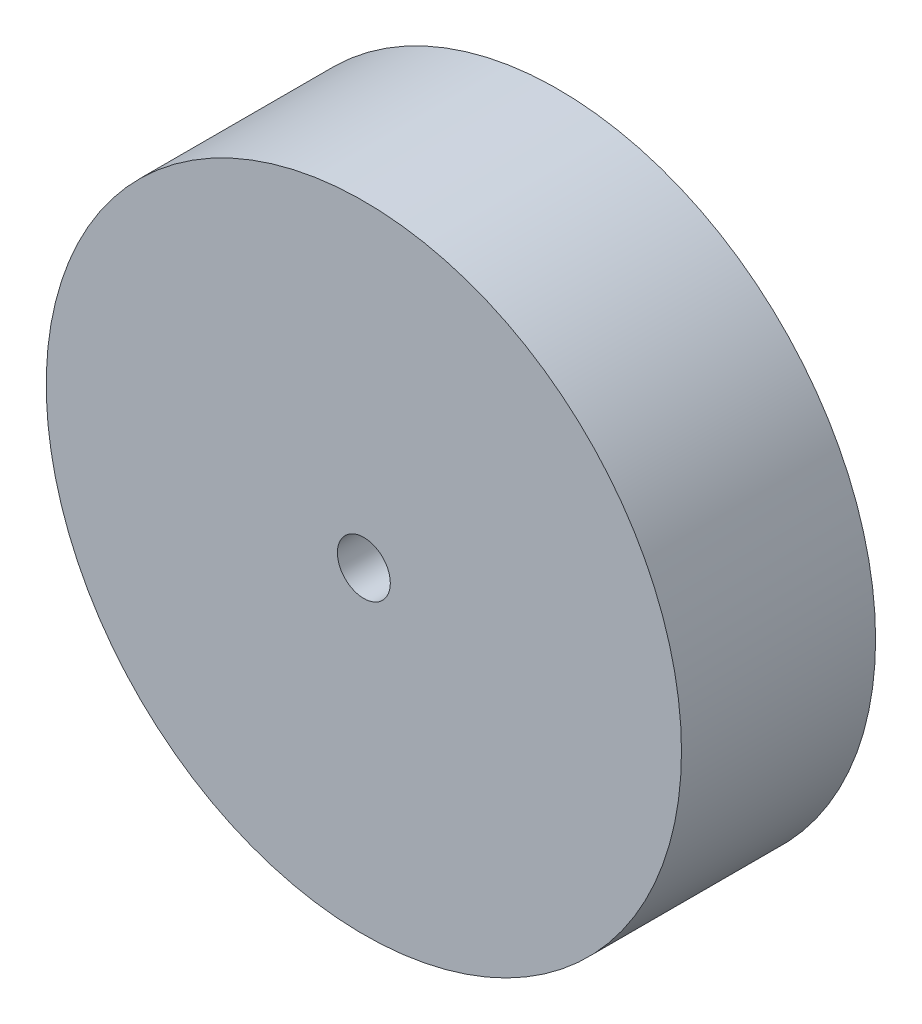
ISO-10303-21;
HEADER;
FILE_DESCRIPTION(('STEP AP214'),'2;1');
FILE_NAME('part.step','',(''),(''),'','','');
FILE_SCHEMA(('AUTOMOTIVE_DESIGN { 1 0 10303 214 1 1 1 1 }'));
ENDSEC;
DATA;
#1=APPLICATION_CONTEXT('core data for automotive mechanical design processes');
#2=APPLICATION_PROTOCOL_DEFINITION('international standard','automotive_design',2000,#1);
#3=PRODUCT_CONTEXT('',#1,'mechanical');
#4=PRODUCT('Part','Part','',(#3));
#5=PRODUCT_RELATED_PRODUCT_CATEGORY('part','',(#4));
#6=PRODUCT_DEFINITION_FORMATION('','',#4);
#7=PRODUCT_DEFINITION_CONTEXT('part definition',#1,'design');
#8=PRODUCT_DEFINITION('design','',#6,#7);
#9=PRODUCT_DEFINITION_SHAPE('','',#8);
#10=(LENGTH_UNIT() NAMED_UNIT(*) SI_UNIT(.MILLI.,.METRE.));
#11=(NAMED_UNIT(*) PLANE_ANGLE_UNIT() SI_UNIT($,.RADIAN.));
#12=(NAMED_UNIT(*) SI_UNIT($,.STERADIAN.) SOLID_ANGLE_UNIT());
#13=UNCERTAINTY_MEASURE_WITH_UNIT(LENGTH_MEASURE(1.E-05),#10,'distance_accuracy_value','');
#14=(GEOMETRIC_REPRESENTATION_CONTEXT(3) GLOBAL_UNCERTAINTY_ASSIGNED_CONTEXT((#13)) GLOBAL_UNIT_ASSIGNED_CONTEXT((#10,
#11,#12)) REPRESENTATION_CONTEXT('',''));
#15=CARTESIAN_POINT('',(0.,0.,0.));
#16=DIRECTION('',(0.,0.,1.));
#17=DIRECTION('',(1.,0.,0.));
#18=AXIS2_PLACEMENT_3D('',#15,#16,#17);
#19=CARTESIAN_POINT('',(0.,0.,3.));
#20=DIRECTION('',(0.,0.,-1.));
#21=DIRECTION('',(-1.,0.,0.));
#22=AXIS2_PLACEMENT_3D('',#19,#20,#21);
#23=CYLINDRICAL_SURFACE('',#22,2.75);
#24=CARTESIAN_POINT('',(0.,0.,3.));
#25=DIRECTION('',(0.,0.,1.));
#26=DIRECTION('',(1.,0.,0.));
#27=AXIS2_PLACEMENT_3D('',#24,#25,#26);
#28=CIRCLE('',#27,2.75);
#29=CARTESIAN_POINT('',(2.75,0.,3.));
#30=VERTEX_POINT('',#29);
#31=EDGE_CURVE('E41',#30,#30,#28,.T.);
#32=ORIENTED_EDGE('',*,*,#31,.F.);
#33=EDGE_LOOP('',(#32));
#34=FACE_BOUND('',#33,.T.);
#35=CARTESIAN_POINT('',(0.,0.,0.));
#36=DIRECTION('',(0.,0.,1.));
#37=DIRECTION('',(1.,0.,0.));
#38=AXIS2_PLACEMENT_3D('',#35,#36,#37);
#39=CIRCLE('',#38,2.75);
#40=CARTESIAN_POINT('',(2.75,0.,0.));
#41=VERTEX_POINT('',#40);
#42=EDGE_CURVE('E45',#41,#41,#39,.T.);
#43=ORIENTED_EDGE('',*,*,#42,.T.);
#44=EDGE_LOOP('',(#43));
#45=FACE_BOUND('',#44,.T.);
#46=ADVANCED_FACE('F30',(#34,#45),#23,.T.);
#47=CARTESIAN_POINT('',(0.,0.,0.));
#48=DIRECTION('',(0.,0.,1.));
#49=DIRECTION('',(1.,0.,0.));
#50=AXIS2_PLACEMENT_3D('',#47,#48,#49);
#51=PLANE('',#50);
#52=ORIENTED_EDGE('',*,*,#42,.F.);
#53=EDGE_LOOP('',(#52));
#54=FACE_BOUND('',#53,.T.);
#55=ADVANCED_FACE('F72',(#54),#51,.F.);
#56=CARTESIAN_POINT('',(0.,0.,8.5));
#57=DIRECTION('',(0.,0.,-1.));
#58=DIRECTION('',(-1.,0.,0.));
#59=AXIS2_PLACEMENT_3D('',#56,#57,#58);
#60=CYLINDRICAL_SURFACE('',#59,9.);
#61=CARTESIAN_POINT('',(0.,0.,8.5));
#62=DIRECTION('',(0.,0.,1.));
#63=DIRECTION('',(1.,0.,0.));
#64=AXIS2_PLACEMENT_3D('',#61,#62,#63);
#65=CIRCLE('',#64,9.);
#66=CARTESIAN_POINT('',(9.,0.,8.5));
#67=VERTEX_POINT('',#66);
#68=EDGE_CURVE('E49',#67,#67,#65,.T.);
#69=ORIENTED_EDGE('',*,*,#68,.F.);
#70=EDGE_LOOP('',(#69));
#71=FACE_BOUND('',#70,.T.);
#72=CARTESIAN_POINT('',(0.,0.,3.));
#73=DIRECTION('',(0.,0.,1.));
#74=DIRECTION('',(1.,0.,0.));
#75=AXIS2_PLACEMENT_3D('',#72,#73,#74);
#76=CIRCLE('',#75,9.);
#77=CARTESIAN_POINT('',(9.,0.,3.));
#78=VERTEX_POINT('',#77);
#79=EDGE_CURVE('E51',#78,#78,#76,.T.);
#80=ORIENTED_EDGE('',*,*,#79,.T.);
#81=EDGE_LOOP('',(#80));
#82=FACE_BOUND('',#81,.T.);
#83=ADVANCED_FACE('F66',(#71,#82),#60,.T.);
#84=CARTESIAN_POINT('',(0.,0.,8.5));
#85=DIRECTION('',(0.,0.,1.));
#86=DIRECTION('',(1.,0.,0.));
#87=AXIS2_PLACEMENT_3D('',#84,#85,#86);
#88=PLANE('',#87);
#89=CARTESIAN_POINT('',(0.,0.,8.5));
#90=DIRECTION('',(0.,0.,1.));
#91=DIRECTION('',(1.,0.,0.));
#92=AXIS2_PLACEMENT_3D('',#89,#90,#91);
#93=CIRCLE('',#92,0.75);
#94=CARTESIAN_POINT('',(0.75,0.,8.5));
#95=VERTEX_POINT('',#94);
#96=EDGE_CURVE('E54',#95,#95,#93,.T.);
#97=ORIENTED_EDGE('',*,*,#96,.F.);
#98=EDGE_LOOP('',(#97));
#99=FACE_BOUND('',#98,.T.);
#100=ORIENTED_EDGE('',*,*,#68,.T.);
#101=EDGE_LOOP('',(#100));
#102=FACE_BOUND('',#101,.T.);
#103=ADVANCED_FACE('F62',(#99,#102),#88,.T.);
#104=CARTESIAN_POINT('',(0.,0.,3.));
#105=DIRECTION('',(0.,0.,1.));
#106=DIRECTION('',(1.,0.,0.));
#107=AXIS2_PLACEMENT_3D('',#104,#105,#106);
#108=PLANE('',#107);
#109=ORIENTED_EDGE('',*,*,#31,.T.);
#110=EDGE_LOOP('',(#109));
#111=FACE_BOUND('',#110,.T.);
#112=ORIENTED_EDGE('',*,*,#79,.F.);
#113=EDGE_LOOP('',(#112));
#114=FACE_BOUND('',#113,.T.);
#115=ADVANCED_FACE('F65',(#111,#114),#108,.F.);
#116=CARTESIAN_POINT('',(0.,0.,1.));
#117=DIRECTION('',(0.,0.,1.));
#118=DIRECTION('',(1.,0.,0.));
#119=AXIS2_PLACEMENT_3D('',#116,#117,#118);
#120=CYLINDRICAL_SURFACE('',#119,0.75);
#121=CARTESIAN_POINT('',(0.,0.,1.7));
#122=DIRECTION('',(0.,0.,1.));
#123=DIRECTION('',(1.,0.,0.));
#124=AXIS2_PLACEMENT_3D('',#121,#122,#123);
#125=CIRCLE('',#124,0.75);
#126=CARTESIAN_POINT('',(0.75,0.,1.7));
#127=VERTEX_POINT('',#126);
#128=EDGE_CURVE('E10',#127,#127,#125,.F.);
#129=ORIENTED_EDGE('',*,*,#128,.T.);
#130=EDGE_LOOP('',(#129));
#131=FACE_BOUND('',#130,.T.);
#132=ORIENTED_EDGE('',*,*,#96,.T.);
#133=EDGE_LOOP('',(#132));
#134=FACE_BOUND('',#133,.T.);
#135=ADVANCED_FACE('F60',(#131,#134),#120,.F.);
#136=CARTESIAN_POINT('',(0.,0.,1.));
#137=DIRECTION('',(0.,0.,1.));
#138=DIRECTION('',(1.,0.,0.));
#139=AXIS2_PLACEMENT_3D('',#136,#137,#138);
#140=PLANE('',#139);
#141=CARTESIAN_POINT('',(0.,0.,1.));
#142=DIRECTION('',(0.,0.,1.));
#143=DIRECTION('',(1.,0.,0.));
#144=AXIS2_PLACEMENT_3D('',#141,#142,#143);
#145=CIRCLE('',#144,0.049999999999998);
#146=CARTESIAN_POINT('',(0.049999999999998,0.,1.));
#147=VERTEX_POINT('',#146);
#148=EDGE_CURVE('E37',#147,#147,#145,.T.);
#149=ORIENTED_EDGE('',*,*,#148,.T.);
#150=EDGE_LOOP('',(#149));
#151=FACE_BOUND('',#150,.T.);
#152=ADVANCED_FACE('F82',(#151),#140,.T.);
#153=CARTESIAN_POINT('',(0.,0.,1.));
#154=DIRECTION('',(0.,0.,1.));
#155=DIRECTION('',(1.,0.,0.));
#156=AXIS2_PLACEMENT_3D('',#153,#154,#155);
#157=CONICAL_SURFACE('',#156,0.049999999999998,0.785398163397451);
#158=ORIENTED_EDGE('',*,*,#128,.F.);
#159=EDGE_LOOP('',(#158));
#160=FACE_BOUND('',#159,.T.);
#161=ORIENTED_EDGE('',*,*,#148,.F.);
#162=EDGE_LOOP('',(#161));
#163=FACE_BOUND('',#162,.T.);
#164=ADVANCED_FACE('F32',(#160,#163),#157,.F.);
#165=CLOSED_SHELL('',(#46,#55,#83,#103,#115,#135,#152,#164));
#166=MANIFOLD_SOLID_BREP('B2',#165);
#167=ADVANCED_BREP_SHAPE_REPRESENTATION('',(#18,#166),#14);
#168=SHAPE_DEFINITION_REPRESENTATION(#9,#167);
ENDSEC;
END-ISO-10303-21;
